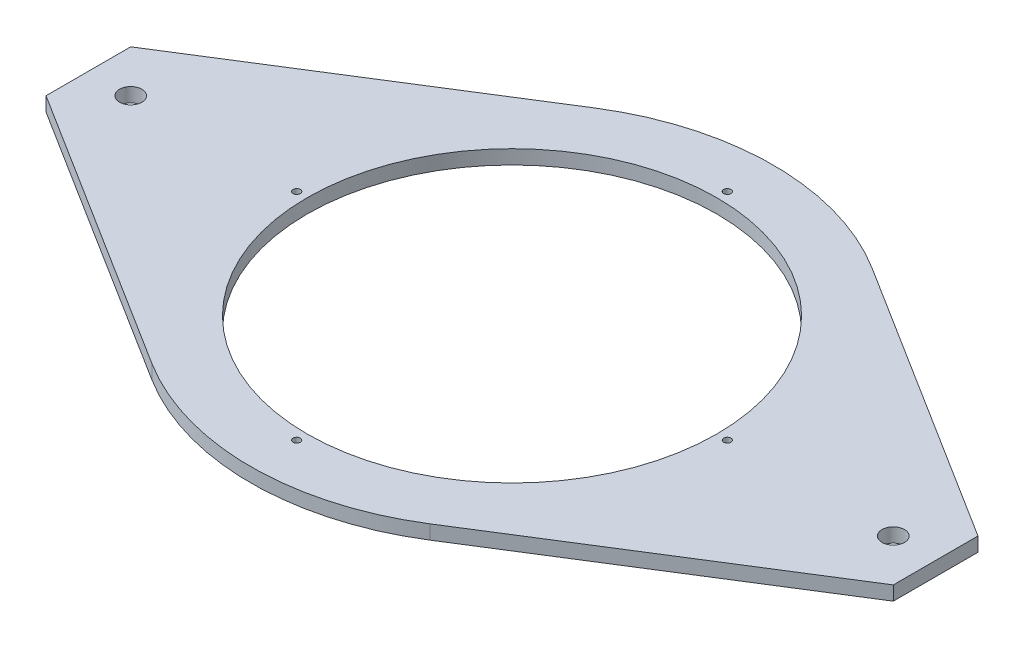
ISO-10303-21;
HEADER;
FILE_DESCRIPTION(('STEP AP214'),'2;1');
FILE_NAME('part.step','',(''),(''),'','','');
FILE_SCHEMA(('AUTOMOTIVE_DESIGN { 1 0 10303 214 1 1 1 1 }'));
ENDSEC;
DATA;
#1=APPLICATION_CONTEXT('core data for automotive mechanical design processes');
#2=APPLICATION_PROTOCOL_DEFINITION('international standard','automotive_design',2000,#1);
#3=PRODUCT_CONTEXT('',#1,'mechanical');
#4=PRODUCT('Part','Part','',(#3));
#5=PRODUCT_RELATED_PRODUCT_CATEGORY('part','',(#4));
#6=PRODUCT_DEFINITION_FORMATION('','',#4);
#7=PRODUCT_DEFINITION_CONTEXT('part definition',#1,'design');
#8=PRODUCT_DEFINITION('design','',#6,#7);
#9=PRODUCT_DEFINITION_SHAPE('','',#8);
#10=(LENGTH_UNIT() NAMED_UNIT(*) SI_UNIT(.MILLI.,.METRE.));
#11=(NAMED_UNIT(*) PLANE_ANGLE_UNIT() SI_UNIT($,.RADIAN.));
#12=(NAMED_UNIT(*) SI_UNIT($,.STERADIAN.) SOLID_ANGLE_UNIT());
#13=UNCERTAINTY_MEASURE_WITH_UNIT(LENGTH_MEASURE(1.E-05),#10,'distance_accuracy_value','');
#14=(GEOMETRIC_REPRESENTATION_CONTEXT(3) GLOBAL_UNCERTAINTY_ASSIGNED_CONTEXT((#13)) GLOBAL_UNIT_ASSIGNED_CONTEXT((#10,
#11,#12)) REPRESENTATION_CONTEXT('',''));
#15=CARTESIAN_POINT('',(0.,0.,0.));
#16=DIRECTION('',(0.,0.,1.));
#17=DIRECTION('',(1.,0.,0.));
#18=AXIS2_PLACEMENT_3D('',#15,#16,#17);
#19=CARTESIAN_POINT('',(0.,6.35,0.));
#20=DIRECTION('',(0.,1.,0.));
#21=DIRECTION('',(0.,0.,1.));
#22=AXIS2_PLACEMENT_3D('',#19,#20,#21);
#23=PLANE('',#22);
#24=CARTESIAN_POINT('',(-171.45,6.35,0.));
#25=DIRECTION('',(0.,1.,0.));
#26=DIRECTION('',(0.,0.,1.));
#27=AXIS2_PLACEMENT_3D('',#24,#25,#26);
#28=CIRCLE('',#27,5.04189999999999);
#29=CARTESIAN_POINT('',(-171.45,6.35,5.04189999999996));
#30=VERTEX_POINT('',#29);
#31=EDGE_CURVE('E219',#30,#30,#28,.T.);
#32=ORIENTED_EDGE('',*,*,#31,.F.);
#33=EDGE_LOOP('',(#32));
#34=FACE_BOUND('',#33,.T.);
#35=CARTESIAN_POINT('',(171.45,6.35,0.));
#36=DIRECTION('',(0.,1.,0.));
#37=DIRECTION('',(0.,0.,1.));
#38=AXIS2_PLACEMENT_3D('',#35,#36,#37);
#39=CIRCLE('',#38,5.04189999999999);
#40=CARTESIAN_POINT('',(171.45,6.35,5.04189999999996));
#41=VERTEX_POINT('',#40);
#42=EDGE_CURVE('E213',#41,#41,#39,.T.);
#43=ORIENTED_EDGE('',*,*,#42,.F.);
#44=EDGE_LOOP('',(#43));
#45=FACE_BOUND('',#44,.T.);
#46=CARTESIAN_POINT('',(0.,6.35,-96.8375));
#47=DIRECTION('',(0.,1.,0.));
#48=DIRECTION('',(0.,0.,1.));
#49=AXIS2_PLACEMENT_3D('',#46,#47,#48);
#50=CIRCLE('',#49,1.63195);
#51=CARTESIAN_POINT('',(0.,6.35,-95.20555));
#52=VERTEX_POINT('',#51);
#53=EDGE_CURVE('E207',#52,#52,#50,.T.);
#54=ORIENTED_EDGE('',*,*,#53,.F.);
#55=EDGE_LOOP('',(#54));
#56=FACE_BOUND('',#55,.T.);
#57=CARTESIAN_POINT('',(96.8375,6.35,0.));
#58=DIRECTION('',(0.,1.,0.));
#59=DIRECTION('',(0.,0.,1.));
#60=AXIS2_PLACEMENT_3D('',#57,#58,#59);
#61=CIRCLE('',#60,1.63194999999999);
#62=CARTESIAN_POINT('',(96.8375,6.35,1.63194999999999));
#63=VERTEX_POINT('',#62);
#64=EDGE_CURVE('E201',#63,#63,#61,.T.);
#65=ORIENTED_EDGE('',*,*,#64,.F.);
#66=EDGE_LOOP('',(#65));
#67=FACE_BOUND('',#66,.T.);
#68=CARTESIAN_POINT('',(0.,6.35,96.8375));
#69=DIRECTION('',(0.,1.,0.));
#70=DIRECTION('',(0.,0.,1.));
#71=AXIS2_PLACEMENT_3D('',#68,#69,#70);
#72=CIRCLE('',#71,1.63195);
#73=CARTESIAN_POINT('',(0.,6.35,98.46945));
#74=VERTEX_POINT('',#73);
#75=EDGE_CURVE('E195',#74,#74,#72,.T.);
#76=ORIENTED_EDGE('',*,*,#75,.F.);
#77=EDGE_LOOP('',(#76));
#78=FACE_BOUND('',#77,.T.);
#79=CARTESIAN_POINT('',(-96.8375,6.35,0.));
#80=DIRECTION('',(0.,1.,0.));
#81=DIRECTION('',(0.,0.,1.));
#82=AXIS2_PLACEMENT_3D('',#79,#80,#81);
#83=CIRCLE('',#82,1.63194999999999);
#84=CARTESIAN_POINT('',(-96.8375,6.35,1.63194999999999));
#85=VERTEX_POINT('',#84);
#86=EDGE_CURVE('E189',#85,#85,#83,.T.);
#87=ORIENTED_EDGE('',*,*,#86,.F.);
#88=EDGE_LOOP('',(#87));
#89=FACE_BOUND('',#88,.T.);
#90=DIRECTION('',(0.846749561525902,0.,-0.531991710514076));
#91=VECTOR('',#90,1.);
#92=CARTESIAN_POINT('',(190.5,6.35,19.05));
#93=LINE('',#92,#91);
#94=CARTESIAN_POINT('',(62.4957261926409,6.35,99.4719047402554));
#95=VERTEX_POINT('',#94);
#96=CARTESIAN_POINT('',(190.5,6.35,19.05));
#97=VERTEX_POINT('',#96);
#98=EDGE_CURVE('E147',#95,#97,#93,.T.);
#99=ORIENTED_EDGE('',*,*,#98,.T.);
#100=DIRECTION('',(0.,0.,-1.));
#101=VECTOR('',#100,1.);
#102=CARTESIAN_POINT('',(190.5,6.35,-19.0499999999996));
#103=LINE('',#102,#101);
#104=CARTESIAN_POINT('',(190.5,6.35,-19.0499999999996));
#105=VERTEX_POINT('',#104);
#106=EDGE_CURVE('E95',#97,#105,#103,.T.);
#107=ORIENTED_EDGE('',*,*,#106,.T.);
#108=DIRECTION('',(-0.846749561525901,0.,-0.531991710514078));
#109=VECTOR('',#108,1.);
#110=CARTESIAN_POINT('',(190.5,6.35,-19.0499999999996));
#111=LINE('',#110,#109);
#112=CARTESIAN_POINT('',(62.4957261926413,6.35,-99.4719047402551));
#113=VERTEX_POINT('',#112);
#114=EDGE_CURVE('E162',#105,#113,#111,.T.);
#115=ORIENTED_EDGE('',*,*,#114,.T.);
#116=CARTESIAN_POINT('',(0.,6.35,0.));
#117=DIRECTION('',(0.,1.,0.));
#118=DIRECTION('',(0.,0.,1.));
#119=AXIS2_PLACEMENT_3D('',#116,#117,#118);
#120=CIRCLE('',#119,117.475);
#121=CARTESIAN_POINT('',(-62.4957261926408,6.35,-99.4719047402555));
#122=VERTEX_POINT('',#121);
#123=EDGE_CURVE('E175',#113,#122,#120,.T.);
#124=ORIENTED_EDGE('',*,*,#123,.T.);
#125=DIRECTION('',(-0.846749561525903,0.,0.531991710514074));
#126=VECTOR('',#125,1.);
#127=CARTESIAN_POINT('',(-190.5,6.35,-19.0500000000005));
#128=LINE('',#127,#126);
#129=CARTESIAN_POINT('',(-190.5,6.35,-19.0500000000005));
#130=VERTEX_POINT('',#129);
#131=EDGE_CURVE('E114',#122,#130,#128,.T.);
#132=ORIENTED_EDGE('',*,*,#131,.T.);
#133=DIRECTION('',(0.,0.,1.));
#134=VECTOR('',#133,1.);
#135=CARTESIAN_POINT('',(-190.5,6.35,-19.0500000000005));
#136=LINE('',#135,#134);
#137=CARTESIAN_POINT('',(-190.5,6.35,19.0499999999996));
#138=VERTEX_POINT('',#137);
#139=EDGE_CURVE('E108',#130,#138,#136,.T.);
#140=ORIENTED_EDGE('',*,*,#139,.T.);
#141=DIRECTION('',(0.846749561525901,0.,0.531991710514078));
#142=VECTOR('',#141,1.);
#143=CARTESIAN_POINT('',(-190.5,6.35,19.0499999999996));
#144=LINE('',#143,#142);
#145=CARTESIAN_POINT('',(-62.4957261926413,6.35,99.4719047402551));
#146=VERTEX_POINT('',#145);
#147=EDGE_CURVE('E112',#138,#146,#144,.T.);
#148=ORIENTED_EDGE('',*,*,#147,.T.);
#149=CARTESIAN_POINT('',(0.,6.35,0.));
#150=DIRECTION('',(0.,1.,0.));
#151=DIRECTION('',(0.,0.,1.));
#152=AXIS2_PLACEMENT_3D('',#149,#150,#151);
#153=CIRCLE('',#152,117.475);
#154=EDGE_CURVE('E52',#146,#95,#153,.T.);
#155=ORIENTED_EDGE('',*,*,#154,.T.);
#156=EDGE_LOOP('',(#99,#107,#115,#124,#132,#140,#148,#155));
#157=FACE_BOUND('',#156,.T.);
#158=CARTESIAN_POINT('',(0.,6.35,0.));
#159=DIRECTION('',(0.,1.,0.));
#160=DIRECTION('',(0.,0.,1.));
#161=AXIS2_PLACEMENT_3D('',#158,#159,#160);
#162=CIRCLE('',#161,92.075);
#163=CARTESIAN_POINT('',(0.,6.35,92.075));
#164=VERTEX_POINT('',#163);
#165=EDGE_CURVE('E136',#164,#164,#162,.T.);
#166=ORIENTED_EDGE('',*,*,#165,.F.);
#167=EDGE_LOOP('',(#166));
#168=FACE_BOUND('',#167,.T.);
#169=ADVANCED_FACE('F35',(#34,#45,#56,#67,#78,#89,#157,#168),#23,.T.);
#170=CARTESIAN_POINT('',(0.,0.,0.));
#171=DIRECTION('',(0.,1.,0.));
#172=DIRECTION('',(0.,0.,1.));
#173=AXIS2_PLACEMENT_3D('',#170,#171,#172);
#174=PLANE('',#173);
#175=CARTESIAN_POINT('',(-171.45,0.,0.));
#176=DIRECTION('',(0.,1.,0.));
#177=DIRECTION('',(0.,0.,1.));
#178=AXIS2_PLACEMENT_3D('',#175,#176,#177);
#179=CIRCLE('',#178,5.04189999999999);
#180=CARTESIAN_POINT('',(-171.45,0.,5.04189999999996));
#181=VERTEX_POINT('',#180);
#182=EDGE_CURVE('E216',#181,#181,#179,.T.);
#183=ORIENTED_EDGE('',*,*,#182,.T.);
#184=EDGE_LOOP('',(#183));
#185=FACE_BOUND('',#184,.T.);
#186=CARTESIAN_POINT('',(171.45,0.,0.));
#187=DIRECTION('',(0.,1.,0.));
#188=DIRECTION('',(0.,0.,1.));
#189=AXIS2_PLACEMENT_3D('',#186,#187,#188);
#190=CIRCLE('',#189,5.04189999999999);
#191=CARTESIAN_POINT('',(171.45,0.,5.04189999999996));
#192=VERTEX_POINT('',#191);
#193=EDGE_CURVE('E210',#192,#192,#190,.T.);
#194=ORIENTED_EDGE('',*,*,#193,.T.);
#195=EDGE_LOOP('',(#194));
#196=FACE_BOUND('',#195,.T.);
#197=CARTESIAN_POINT('',(0.,0.,-96.8375));
#198=DIRECTION('',(0.,1.,0.));
#199=DIRECTION('',(0.,0.,1.));
#200=AXIS2_PLACEMENT_3D('',#197,#198,#199);
#201=CIRCLE('',#200,1.63195);
#202=CARTESIAN_POINT('',(0.,0.,-95.20555));
#203=VERTEX_POINT('',#202);
#204=EDGE_CURVE('E204',#203,#203,#201,.T.);
#205=ORIENTED_EDGE('',*,*,#204,.T.);
#206=EDGE_LOOP('',(#205));
#207=FACE_BOUND('',#206,.T.);
#208=CARTESIAN_POINT('',(96.8375,0.,0.));
#209=DIRECTION('',(0.,1.,0.));
#210=DIRECTION('',(0.,0.,1.));
#211=AXIS2_PLACEMENT_3D('',#208,#209,#210);
#212=CIRCLE('',#211,1.63194999999999);
#213=CARTESIAN_POINT('',(96.8375,0.,1.63194999999999));
#214=VERTEX_POINT('',#213);
#215=EDGE_CURVE('E198',#214,#214,#212,.T.);
#216=ORIENTED_EDGE('',*,*,#215,.T.);
#217=EDGE_LOOP('',(#216));
#218=FACE_BOUND('',#217,.T.);
#219=CARTESIAN_POINT('',(0.,0.,96.8375));
#220=DIRECTION('',(0.,1.,0.));
#221=DIRECTION('',(0.,0.,1.));
#222=AXIS2_PLACEMENT_3D('',#219,#220,#221);
#223=CIRCLE('',#222,1.63195);
#224=CARTESIAN_POINT('',(0.,0.,98.46945));
#225=VERTEX_POINT('',#224);
#226=EDGE_CURVE('E192',#225,#225,#223,.T.);
#227=ORIENTED_EDGE('',*,*,#226,.T.);
#228=EDGE_LOOP('',(#227));
#229=FACE_BOUND('',#228,.T.);
#230=CARTESIAN_POINT('',(-96.8375,0.,0.));
#231=DIRECTION('',(0.,1.,0.));
#232=DIRECTION('',(0.,0.,1.));
#233=AXIS2_PLACEMENT_3D('',#230,#231,#232);
#234=CIRCLE('',#233,1.63194999999999);
#235=CARTESIAN_POINT('',(-96.8375,0.,1.63194999999999));
#236=VERTEX_POINT('',#235);
#237=EDGE_CURVE('E184',#236,#236,#234,.T.);
#238=ORIENTED_EDGE('',*,*,#237,.T.);
#239=EDGE_LOOP('',(#238));
#240=FACE_BOUND('',#239,.T.);
#241=DIRECTION('',(0.846749561525902,0.,-0.531991710514076));
#242=VECTOR('',#241,1.);
#243=CARTESIAN_POINT('',(190.5,0.,19.05));
#244=LINE('',#243,#242);
#245=CARTESIAN_POINT('',(62.4957261926409,0.,99.4719047402554));
#246=VERTEX_POINT('',#245);
#247=CARTESIAN_POINT('',(190.5,0.,19.05));
#248=VERTEX_POINT('',#247);
#249=EDGE_CURVE('E132',#246,#248,#244,.T.);
#250=ORIENTED_EDGE('',*,*,#249,.F.);
#251=CARTESIAN_POINT('',(0.,0.,0.));
#252=DIRECTION('',(0.,1.,0.));
#253=DIRECTION('',(0.,0.,1.));
#254=AXIS2_PLACEMENT_3D('',#251,#252,#253);
#255=CIRCLE('',#254,117.475);
#256=CARTESIAN_POINT('',(-62.4957261926413,0.,99.4719047402551));
#257=VERTEX_POINT('',#256);
#258=EDGE_CURVE('E87',#257,#246,#255,.T.);
#259=ORIENTED_EDGE('',*,*,#258,.F.);
#260=DIRECTION('',(0.846749561525901,0.,0.531991710514078));
#261=VECTOR('',#260,1.);
#262=CARTESIAN_POINT('',(-190.5,0.,19.0499999999996));
#263=LINE('',#262,#261);
#264=CARTESIAN_POINT('',(-190.5,0.,19.0499999999996));
#265=VERTEX_POINT('',#264);
#266=EDGE_CURVE('E81',#265,#257,#263,.T.);
#267=ORIENTED_EDGE('',*,*,#266,.F.);
#268=DIRECTION('',(0.,0.,1.));
#269=VECTOR('',#268,1.);
#270=CARTESIAN_POINT('',(-190.5,0.,-19.0500000000005));
#271=LINE('',#270,#269);
#272=CARTESIAN_POINT('',(-190.5,0.,-19.0500000000005));
#273=VERTEX_POINT('',#272);
#274=EDGE_CURVE('E122',#273,#265,#271,.T.);
#275=ORIENTED_EDGE('',*,*,#274,.F.);
#276=DIRECTION('',(-0.846749561525903,0.,0.531991710514074));
#277=VECTOR('',#276,1.);
#278=CARTESIAN_POINT('',(-190.5,0.,-19.0500000000005));
#279=LINE('',#278,#277);
#280=CARTESIAN_POINT('',(-62.4957261926408,0.,-99.4719047402555));
#281=VERTEX_POINT('',#280);
#282=EDGE_CURVE('E142',#281,#273,#279,.T.);
#283=ORIENTED_EDGE('',*,*,#282,.F.);
#284=CARTESIAN_POINT('',(0.,0.,0.));
#285=DIRECTION('',(0.,1.,0.));
#286=DIRECTION('',(0.,0.,1.));
#287=AXIS2_PLACEMENT_3D('',#284,#285,#286);
#288=CIRCLE('',#287,117.475);
#289=CARTESIAN_POINT('',(62.4957261926413,0.,-99.4719047402551));
#290=VERTEX_POINT('',#289);
#291=EDGE_CURVE('E140',#290,#281,#288,.T.);
#292=ORIENTED_EDGE('',*,*,#291,.F.);
#293=DIRECTION('',(-0.846749561525901,0.,-0.531991710514078));
#294=VECTOR('',#293,1.);
#295=CARTESIAN_POINT('',(190.5,0.,-19.0499999999996));
#296=LINE('',#295,#294);
#297=CARTESIAN_POINT('',(190.5,0.,-19.0499999999996));
#298=VERTEX_POINT('',#297);
#299=EDGE_CURVE('E138',#298,#290,#296,.T.);
#300=ORIENTED_EDGE('',*,*,#299,.F.);
#301=DIRECTION('',(0.,0.,-1.));
#302=VECTOR('',#301,1.);
#303=CARTESIAN_POINT('',(190.5,0.,-19.0499999999996));
#304=LINE('',#303,#302);
#305=EDGE_CURVE('E135',#248,#298,#304,.T.);
#306=ORIENTED_EDGE('',*,*,#305,.F.);
#307=EDGE_LOOP('',(#250,#259,#267,#275,#283,#292,#300,#306));
#308=FACE_BOUND('',#307,.T.);
#309=CARTESIAN_POINT('',(0.,0.,0.));
#310=DIRECTION('',(0.,1.,0.));
#311=DIRECTION('',(0.,0.,1.));
#312=AXIS2_PLACEMENT_3D('',#309,#310,#311);
#313=CIRCLE('',#312,92.075);
#314=CARTESIAN_POINT('',(0.,0.,92.075));
#315=VERTEX_POINT('',#314);
#316=EDGE_CURVE('E181',#315,#315,#313,.T.);
#317=ORIENTED_EDGE('',*,*,#316,.T.);
#318=EDGE_LOOP('',(#317));
#319=FACE_BOUND('',#318,.T.);
#320=ADVANCED_FACE('F166',(#185,#196,#207,#218,#229,#240,#308,#319),#174,.F.);
#321=CARTESIAN_POINT('',(190.5,6.35,19.05));
#322=DIRECTION('',(-0.531991710514076,0.,-0.846749561525902));
#323=DIRECTION('',(-0.846749561525902,0.,0.531991710514077));
#324=AXIS2_PLACEMENT_3D('',#321,#322,#323);
#325=PLANE('',#324);
#326=ORIENTED_EDGE('',*,*,#249,.T.);
#327=DIRECTION('',(0.,-1.,0.));
#328=VECTOR('',#327,1.);
#329=CARTESIAN_POINT('',(190.5,6.35,19.05));
#330=LINE('',#329,#328);
#331=EDGE_CURVE('E11',#97,#248,#330,.T.);
#332=ORIENTED_EDGE('',*,*,#331,.F.);
#333=ORIENTED_EDGE('',*,*,#98,.F.);
#334=DIRECTION('',(0.,-1.,0.));
#335=VECTOR('',#334,1.);
#336=CARTESIAN_POINT('',(62.4957261926409,6.35,99.4719047402554));
#337=LINE('',#336,#335);
#338=EDGE_CURVE('E128',#95,#246,#337,.T.);
#339=ORIENTED_EDGE('',*,*,#338,.T.);
#340=EDGE_LOOP('',(#326,#332,#333,#339));
#341=FACE_BOUND('',#340,.T.);
#342=ADVANCED_FACE('F37',(#341),#325,.F.);
#343=CARTESIAN_POINT('',(190.5,6.35,-19.0499999999996));
#344=DIRECTION('',(-1.,0.,0.));
#345=DIRECTION('',(0.,0.,1.));
#346=AXIS2_PLACEMENT_3D('',#343,#344,#345);
#347=PLANE('',#346);
#348=ORIENTED_EDGE('',*,*,#305,.T.);
#349=DIRECTION('',(0.,-1.,0.));
#350=VECTOR('',#349,1.);
#351=CARTESIAN_POINT('',(190.5,6.35,-19.0499999999996));
#352=LINE('',#351,#350);
#353=EDGE_CURVE('E44',#105,#298,#352,.T.);
#354=ORIENTED_EDGE('',*,*,#353,.F.);
#355=ORIENTED_EDGE('',*,*,#106,.F.);
#356=ORIENTED_EDGE('',*,*,#331,.T.);
#357=EDGE_LOOP('',(#348,#354,#355,#356));
#358=FACE_BOUND('',#357,.T.);
#359=ADVANCED_FACE('F271',(#358),#347,.F.);
#360=CARTESIAN_POINT('',(190.5,6.35,-19.0499999999996));
#361=DIRECTION('',(-0.531991710514078,0.,0.846749561525901));
#362=DIRECTION('',(0.846749561525901,0.,0.531991710514078));
#363=AXIS2_PLACEMENT_3D('',#360,#361,#362);
#364=PLANE('',#363);
#365=ORIENTED_EDGE('',*,*,#299,.T.);
#366=DIRECTION('',(0.,-1.,0.));
#367=VECTOR('',#366,1.);
#368=CARTESIAN_POINT('',(62.4957261926413,6.35,-99.4719047402551));
#369=LINE('',#368,#367);
#370=EDGE_CURVE('E154',#113,#290,#369,.T.);
#371=ORIENTED_EDGE('',*,*,#370,.F.);
#372=ORIENTED_EDGE('',*,*,#114,.F.);
#373=ORIENTED_EDGE('',*,*,#353,.T.);
#374=EDGE_LOOP('',(#365,#371,#372,#373));
#375=FACE_BOUND('',#374,.T.);
#376=ADVANCED_FACE('F160',(#375),#364,.F.);
#377=CARTESIAN_POINT('',(0.,6.35,0.));
#378=DIRECTION('',(0.,-1.,0.));
#379=DIRECTION('',(0.,0.,-1.));
#380=AXIS2_PLACEMENT_3D('',#377,#378,#379);
#381=CYLINDRICAL_SURFACE('',#380,117.475);
#382=ORIENTED_EDGE('',*,*,#291,.T.);
#383=DIRECTION('',(0.,-1.,0.));
#384=VECTOR('',#383,1.);
#385=CARTESIAN_POINT('',(-62.4957261926408,6.35,-99.4719047402555));
#386=LINE('',#385,#384);
#387=EDGE_CURVE('E151',#122,#281,#386,.T.);
#388=ORIENTED_EDGE('',*,*,#387,.F.);
#389=ORIENTED_EDGE('',*,*,#123,.F.);
#390=ORIENTED_EDGE('',*,*,#370,.T.);
#391=EDGE_LOOP('',(#382,#388,#389,#390));
#392=FACE_BOUND('',#391,.T.);
#393=ADVANCED_FACE('F171',(#392),#381,.T.);
#394=CARTESIAN_POINT('',(-190.5,6.35,-19.0500000000005));
#395=DIRECTION('',(0.531991710514074,0.,0.846749561525903));
#396=DIRECTION('',(0.846749561525903,0.,-0.531991710514074));
#397=AXIS2_PLACEMENT_3D('',#394,#395,#396);
#398=PLANE('',#397);
#399=ORIENTED_EDGE('',*,*,#282,.T.);
#400=DIRECTION('',(0.,-1.,0.));
#401=VECTOR('',#400,1.);
#402=CARTESIAN_POINT('',(-190.5,6.35,-19.0500000000005));
#403=LINE('',#402,#401);
#404=EDGE_CURVE('E123',#130,#273,#403,.T.);
#405=ORIENTED_EDGE('',*,*,#404,.F.);
#406=ORIENTED_EDGE('',*,*,#131,.F.);
#407=ORIENTED_EDGE('',*,*,#387,.T.);
#408=EDGE_LOOP('',(#399,#405,#406,#407));
#409=FACE_BOUND('',#408,.T.);
#410=ADVANCED_FACE('F174',(#409),#398,.F.);
#411=CARTESIAN_POINT('',(-190.5,6.35,-19.0500000000005));
#412=DIRECTION('',(1.,0.,0.));
#413=DIRECTION('',(0.,0.,-1.));
#414=AXIS2_PLACEMENT_3D('',#411,#412,#413);
#415=PLANE('',#414);
#416=ORIENTED_EDGE('',*,*,#274,.T.);
#417=DIRECTION('',(0.,-1.,0.));
#418=VECTOR('',#417,1.);
#419=CARTESIAN_POINT('',(-190.5,6.35,19.0499999999996));
#420=LINE('',#419,#418);
#421=EDGE_CURVE('E119',#138,#265,#420,.T.);
#422=ORIENTED_EDGE('',*,*,#421,.F.);
#423=ORIENTED_EDGE('',*,*,#139,.F.);
#424=ORIENTED_EDGE('',*,*,#404,.T.);
#425=EDGE_LOOP('',(#416,#422,#423,#424));
#426=FACE_BOUND('',#425,.T.);
#427=ADVANCED_FACE('F120',(#426),#415,.F.);
#428=CARTESIAN_POINT('',(-190.5,6.35,19.0499999999996));
#429=DIRECTION('',(0.531991710514078,0.,-0.846749561525901));
#430=DIRECTION('',(-0.846749561525901,0.,-0.531991710514078));
#431=AXIS2_PLACEMENT_3D('',#428,#429,#430);
#432=PLANE('',#431);
#433=ORIENTED_EDGE('',*,*,#266,.T.);
#434=DIRECTION('',(0.,-1.,0.));
#435=VECTOR('',#434,1.);
#436=CARTESIAN_POINT('',(-62.4957261926413,6.35,99.4719047402551));
#437=LINE('',#436,#435);
#438=EDGE_CURVE('E124',#146,#257,#437,.T.);
#439=ORIENTED_EDGE('',*,*,#438,.F.);
#440=ORIENTED_EDGE('',*,*,#147,.F.);
#441=ORIENTED_EDGE('',*,*,#421,.T.);
#442=EDGE_LOOP('',(#433,#439,#440,#441));
#443=FACE_BOUND('',#442,.T.);
#444=ADVANCED_FACE('F126',(#443),#432,.F.);
#445=CARTESIAN_POINT('',(0.,6.35,0.));
#446=DIRECTION('',(0.,-1.,0.));
#447=DIRECTION('',(0.,0.,-1.));
#448=AXIS2_PLACEMENT_3D('',#445,#446,#447);
#449=CYLINDRICAL_SURFACE('',#448,117.475);
#450=ORIENTED_EDGE('',*,*,#258,.T.);
#451=ORIENTED_EDGE('',*,*,#338,.F.);
#452=ORIENTED_EDGE('',*,*,#154,.F.);
#453=ORIENTED_EDGE('',*,*,#438,.T.);
#454=EDGE_LOOP('',(#450,#451,#452,#453));
#455=FACE_BOUND('',#454,.T.);
#456=ADVANCED_FACE('F251',(#455),#449,.T.);
#457=CARTESIAN_POINT('',(0.,6.35,0.));
#458=DIRECTION('',(0.,-1.,0.));
#459=DIRECTION('',(0.,0.,-1.));
#460=AXIS2_PLACEMENT_3D('',#457,#458,#459);
#461=CYLINDRICAL_SURFACE('',#460,92.075);
#462=ORIENTED_EDGE('',*,*,#165,.T.);
#463=EDGE_LOOP('',(#462));
#464=FACE_BOUND('',#463,.T.);
#465=ORIENTED_EDGE('',*,*,#316,.F.);
#466=EDGE_LOOP('',(#465));
#467=FACE_BOUND('',#466,.T.);
#468=ADVANCED_FACE('F241',(#464,#467),#461,.F.);
#469=CARTESIAN_POINT('',(-96.8375,6.35,0.));
#470=DIRECTION('',(0.,1.,0.));
#471=DIRECTION('',(0.,0.,1.));
#472=AXIS2_PLACEMENT_3D('',#469,#470,#471);
#473=CYLINDRICAL_SURFACE('',#472,1.63194999999999);
#474=ORIENTED_EDGE('',*,*,#237,.F.);
#475=EDGE_LOOP('',(#474));
#476=FACE_BOUND('',#475,.T.);
#477=ORIENTED_EDGE('',*,*,#86,.T.);
#478=EDGE_LOOP('',(#477));
#479=FACE_BOUND('',#478,.T.);
#480=ADVANCED_FACE('F238',(#476,#479),#473,.F.);
#481=CARTESIAN_POINT('',(0.,6.35,96.8375));
#482=DIRECTION('',(0.,1.,0.));
#483=DIRECTION('',(0.,0.,1.));
#484=AXIS2_PLACEMENT_3D('',#481,#482,#483);
#485=CYLINDRICAL_SURFACE('',#484,1.63195);
#486=ORIENTED_EDGE('',*,*,#226,.F.);
#487=EDGE_LOOP('',(#486));
#488=FACE_BOUND('',#487,.T.);
#489=ORIENTED_EDGE('',*,*,#75,.T.);
#490=EDGE_LOOP('',(#489));
#491=FACE_BOUND('',#490,.T.);
#492=ADVANCED_FACE('F240',(#488,#491),#485,.F.);
#493=CARTESIAN_POINT('',(96.8375,6.35,0.));
#494=DIRECTION('',(0.,1.,0.));
#495=DIRECTION('',(0.,0.,1.));
#496=AXIS2_PLACEMENT_3D('',#493,#494,#495);
#497=CYLINDRICAL_SURFACE('',#496,1.63194999999999);
#498=ORIENTED_EDGE('',*,*,#215,.F.);
#499=EDGE_LOOP('',(#498));
#500=FACE_BOUND('',#499,.T.);
#501=ORIENTED_EDGE('',*,*,#64,.T.);
#502=EDGE_LOOP('',(#501));
#503=FACE_BOUND('',#502,.T.);
#504=ADVANCED_FACE('F248',(#500,#503),#497,.F.);
#505=CARTESIAN_POINT('',(0.,6.35,-96.8375));
#506=DIRECTION('',(0.,1.,0.));
#507=DIRECTION('',(0.,0.,1.));
#508=AXIS2_PLACEMENT_3D('',#505,#506,#507);
#509=CYLINDRICAL_SURFACE('',#508,1.63195);
#510=ORIENTED_EDGE('',*,*,#204,.F.);
#511=EDGE_LOOP('',(#510));
#512=FACE_BOUND('',#511,.T.);
#513=ORIENTED_EDGE('',*,*,#53,.T.);
#514=EDGE_LOOP('',(#513));
#515=FACE_BOUND('',#514,.T.);
#516=ADVANCED_FACE('F297',(#512,#515),#509,.F.);
#517=CARTESIAN_POINT('',(171.45,6.35,0.));
#518=DIRECTION('',(0.,1.,0.));
#519=DIRECTION('',(0.,0.,1.));
#520=AXIS2_PLACEMENT_3D('',#517,#518,#519);
#521=CYLINDRICAL_SURFACE('',#520,5.04189999999999);
#522=ORIENTED_EDGE('',*,*,#193,.F.);
#523=EDGE_LOOP('',(#522));
#524=FACE_BOUND('',#523,.T.);
#525=ORIENTED_EDGE('',*,*,#42,.T.);
#526=EDGE_LOOP('',(#525));
#527=FACE_BOUND('',#526,.T.);
#528=ADVANCED_FACE('F302',(#524,#527),#521,.F.);
#529=CARTESIAN_POINT('',(-171.45,6.35,0.));
#530=DIRECTION('',(0.,1.,0.));
#531=DIRECTION('',(0.,0.,1.));
#532=AXIS2_PLACEMENT_3D('',#529,#530,#531);
#533=CYLINDRICAL_SURFACE('',#532,5.04189999999999);
#534=ORIENTED_EDGE('',*,*,#182,.F.);
#535=EDGE_LOOP('',(#534));
#536=FACE_BOUND('',#535,.T.);
#537=ORIENTED_EDGE('',*,*,#31,.T.);
#538=EDGE_LOOP('',(#537));
#539=FACE_BOUND('',#538,.T.);
#540=ADVANCED_FACE('F223',(#536,#539),#533,.F.);
#541=CLOSED_SHELL('',(#169,#320,#342,#359,#376,#393,#410,#427,#444,#456,#468,#480,#492,#504,
#516,#528,#540));
#542=MANIFOLD_SOLID_BREP('B2',#541);
#543=ADVANCED_BREP_SHAPE_REPRESENTATION('',(#18,#542),#14);
#544=SHAPE_DEFINITION_REPRESENTATION(#9,#543);
ENDSEC;
END-ISO-10303-21;
